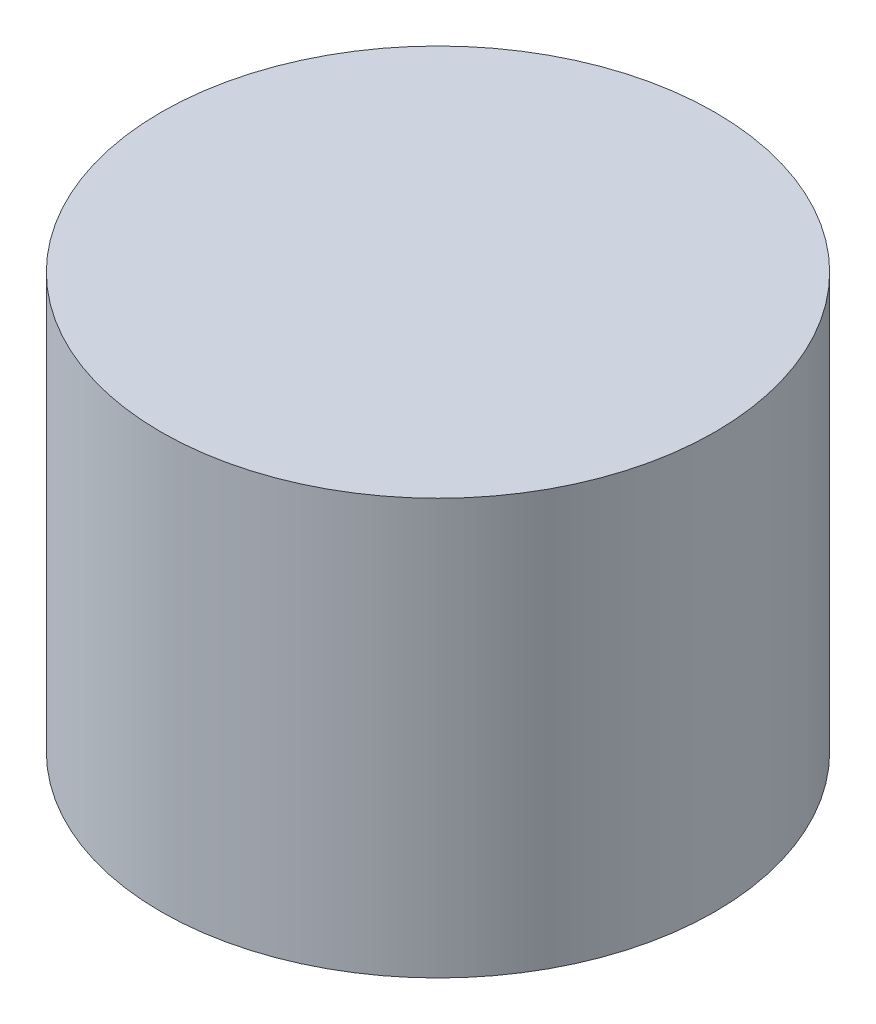
ISO-10303-21;
HEADER;
FILE_DESCRIPTION(('STEP AP214'),'2;1');
FILE_NAME('part.step','',(''),(''),'','','');
FILE_SCHEMA(('AUTOMOTIVE_DESIGN { 1 0 10303 214 1 1 1 1 }'));
ENDSEC;
DATA;
#1=APPLICATION_CONTEXT('core data for automotive mechanical design processes');
#2=APPLICATION_PROTOCOL_DEFINITION('international standard','automotive_design',2000,#1);
#3=PRODUCT_CONTEXT('',#1,'mechanical');
#4=PRODUCT('Part','Part','',(#3));
#5=PRODUCT_RELATED_PRODUCT_CATEGORY('part','',(#4));
#6=PRODUCT_DEFINITION_FORMATION('','',#4);
#7=PRODUCT_DEFINITION_CONTEXT('part definition',#1,'design');
#8=PRODUCT_DEFINITION('design','',#6,#7);
#9=PRODUCT_DEFINITION_SHAPE('','',#8);
#10=(LENGTH_UNIT() NAMED_UNIT(*) SI_UNIT(.MILLI.,.METRE.));
#11=(NAMED_UNIT(*) PLANE_ANGLE_UNIT() SI_UNIT($,.RADIAN.));
#12=(NAMED_UNIT(*) SI_UNIT($,.STERADIAN.) SOLID_ANGLE_UNIT());
#13=UNCERTAINTY_MEASURE_WITH_UNIT(LENGTH_MEASURE(1.E-05),#10,'distance_accuracy_value','');
#14=(GEOMETRIC_REPRESENTATION_CONTEXT(3) GLOBAL_UNCERTAINTY_ASSIGNED_CONTEXT((#13)) GLOBAL_UNIT_ASSIGNED_CONTEXT((#10,
#11,#12)) REPRESENTATION_CONTEXT('',''));
#15=CARTESIAN_POINT('',(0.,0.,0.));
#16=DIRECTION('',(0.,0.,1.));
#17=DIRECTION('',(1.,0.,0.));
#18=AXIS2_PLACEMENT_3D('',#15,#16,#17);
#19=CARTESIAN_POINT('',(0.,38.1,0.));
#20=DIRECTION('',(0.,-1.,0.));
#21=DIRECTION('',(0.,0.,-1.));
#22=AXIS2_PLACEMENT_3D('',#19,#20,#21);
#23=CYLINDRICAL_SURFACE('',#22,25.4);
#24=CARTESIAN_POINT('',(0.,38.1,0.));
#25=DIRECTION('',(0.,1.,0.));
#26=DIRECTION('',(0.,0.,1.));
#27=AXIS2_PLACEMENT_3D('',#24,#25,#26);
#28=CIRCLE('',#27,25.4);
#29=CARTESIAN_POINT('',(0.,38.1,25.4));
#30=VERTEX_POINT('',#29);
#31=EDGE_CURVE('E10',#30,#30,#28,.T.);
#32=ORIENTED_EDGE('',*,*,#31,.F.);
#33=EDGE_LOOP('',(#32));
#34=FACE_BOUND('',#33,.T.);
#35=CARTESIAN_POINT('',(0.,0.,0.));
#36=DIRECTION('',(0.,1.,0.));
#37=DIRECTION('',(0.,0.,1.));
#38=AXIS2_PLACEMENT_3D('',#35,#36,#37);
#39=CIRCLE('',#38,25.4);
#40=CARTESIAN_POINT('',(0.,0.,25.4));
#41=VERTEX_POINT('',#40);
#42=EDGE_CURVE('E46',#41,#41,#39,.T.);
#43=ORIENTED_EDGE('',*,*,#42,.T.);
#44=EDGE_LOOP('',(#43));
#45=FACE_BOUND('',#44,.T.);
#46=ADVANCED_FACE('F43',(#34,#45),#23,.T.);
#47=CARTESIAN_POINT('',(0.,38.1,0.));
#48=DIRECTION('',(0.,1.,0.));
#49=DIRECTION('',(0.,0.,1.));
#50=AXIS2_PLACEMENT_3D('',#47,#48,#49);
#51=PLANE('',#50);
#52=ORIENTED_EDGE('',*,*,#31,.T.);
#53=EDGE_LOOP('',(#52));
#54=FACE_BOUND('',#53,.T.);
#55=ADVANCED_FACE('F60',(#54),#51,.T.);
#56=CARTESIAN_POINT('',(0.,0.,0.));
#57=DIRECTION('',(0.,1.,0.));
#58=DIRECTION('',(0.,0.,1.));
#59=AXIS2_PLACEMENT_3D('',#56,#57,#58);
#60=PLANE('',#59);
#61=ORIENTED_EDGE('',*,*,#42,.F.);
#62=EDGE_LOOP('',(#61));
#63=FACE_BOUND('',#62,.T.);
#64=ADVANCED_FACE('F58',(#63),#60,.F.);
#65=CLOSED_SHELL('',(#46,#55,#64));
#66=MANIFOLD_SOLID_BREP('B2',#65);
#67=ADVANCED_BREP_SHAPE_REPRESENTATION('',(#18,#66),#14);
#68=SHAPE_DEFINITION_REPRESENTATION(#9,#67);
ENDSEC;
END-ISO-10303-21;
